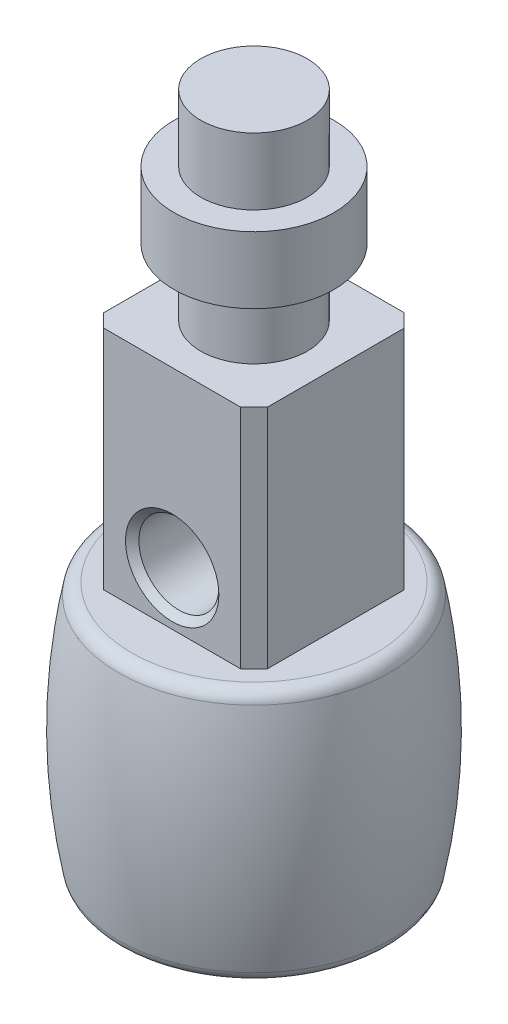
ISO-10303-21;
HEADER;
FILE_DESCRIPTION(('STEP AP214'),'2;1');
FILE_NAME('part.step','',(''),(''),'','','');
FILE_SCHEMA(('AUTOMOTIVE_DESIGN { 1 0 10303 214 1 1 1 1 }'));
ENDSEC;
DATA;
#1=APPLICATION_CONTEXT('core data for automotive mechanical design processes');
#2=APPLICATION_PROTOCOL_DEFINITION('international standard','automotive_design',2000,#1);
#3=PRODUCT_CONTEXT('',#1,'mechanical');
#4=PRODUCT('Part','Part','',(#3));
#5=PRODUCT_RELATED_PRODUCT_CATEGORY('part','',(#4));
#6=PRODUCT_DEFINITION_FORMATION('','',#4);
#7=PRODUCT_DEFINITION_CONTEXT('part definition',#1,'design');
#8=PRODUCT_DEFINITION('design','',#6,#7);
#9=PRODUCT_DEFINITION_SHAPE('','',#8);
#10=(LENGTH_UNIT() NAMED_UNIT(*) SI_UNIT(.MILLI.,.METRE.));
#11=(NAMED_UNIT(*) PLANE_ANGLE_UNIT() SI_UNIT($,.RADIAN.));
#12=(NAMED_UNIT(*) SI_UNIT($,.STERADIAN.) SOLID_ANGLE_UNIT());
#13=UNCERTAINTY_MEASURE_WITH_UNIT(LENGTH_MEASURE(1.E-05),#10,'distance_accuracy_value','');
#14=(GEOMETRIC_REPRESENTATION_CONTEXT(3) GLOBAL_UNCERTAINTY_ASSIGNED_CONTEXT((#13)) GLOBAL_UNIT_ASSIGNED_CONTEXT((#10,
#11,#12)) REPRESENTATION_CONTEXT('',''));
#15=CARTESIAN_POINT('',(0.,0.,0.));
#16=DIRECTION('',(0.,0.,1.));
#17=DIRECTION('',(1.,0.,0.));
#18=AXIS2_PLACEMENT_3D('',#15,#16,#17);
#19=CARTESIAN_POINT('',(4.,36.,0.));
#20=DIRECTION('',(0.,1.,0.));
#21=DIRECTION('',(0.,0.,1.));
#22=AXIS2_PLACEMENT_3D('',#19,#20,#21);
#23=PLANE('',#22);
#24=CARTESIAN_POINT('',(0.,36.,0.));
#25=DIRECTION('',(0.,-1.,0.));
#26=DIRECTION('',(0.,0.,-1.));
#27=AXIS2_PLACEMENT_3D('',#24,#25,#26);
#28=CIRCLE('',#27,4.);
#29=CARTESIAN_POINT('',(0.,36.,-4.));
#30=VERTEX_POINT('',#29);
#31=EDGE_CURVE('E157',#30,#30,#28,.T.);
#32=ORIENTED_EDGE('',*,*,#31,.T.);
#33=EDGE_LOOP('',(#32));
#34=FACE_BOUND('',#33,.T.);
#35=DIRECTION('',(-1.,0.,0.));
#36=VECTOR('',#35,1.);
#37=CARTESIAN_POINT('',(-5.13471383479231,36.,-6.13471383479234));
#38=LINE('',#37,#36);
#39=CARTESIAN_POINT('',(5.13471383479231,36.,-6.13471383479234));
#40=VERTEX_POINT('',#39);
#41=CARTESIAN_POINT('',(-5.13471383479231,36.,-6.13471383479234));
#42=VERTEX_POINT('',#41);
#43=EDGE_CURVE('E125',#40,#42,#38,.T.);
#44=ORIENTED_EDGE('',*,*,#43,.T.);
#45=DIRECTION('',(-0.707106781186548,0.,0.707106781186548));
#46=VECTOR('',#45,1.);
#47=CARTESIAN_POINT('',(-6.13471383479231,36.,-5.13471383479234));
#48=LINE('',#47,#46);
#49=CARTESIAN_POINT('',(-6.13471383479231,36.,-5.13471383479234));
#50=VERTEX_POINT('',#49);
#51=EDGE_CURVE('E53',#42,#50,#48,.T.);
#52=ORIENTED_EDGE('',*,*,#51,.T.);
#53=DIRECTION('',(0.,0.,1.));
#54=VECTOR('',#53,1.);
#55=CARTESIAN_POINT('',(-6.13471383479231,36.,-5.13471383479234));
#56=LINE('',#55,#54);
#57=CARTESIAN_POINT('',(-6.13471383479231,36.,5.13471383479234));
#58=VERTEX_POINT('',#57);
#59=EDGE_CURVE('E114',#50,#58,#56,.T.);
#60=ORIENTED_EDGE('',*,*,#59,.T.);
#61=DIRECTION('',(0.707106781186548,0.,0.707106781186548));
#62=VECTOR('',#61,1.);
#63=CARTESIAN_POINT('',(-6.13471383479231,36.,5.13471383479234));
#64=LINE('',#63,#62);
#65=CARTESIAN_POINT('',(-5.13471383479231,36.,6.13471383479234));
#66=VERTEX_POINT('',#65);
#67=EDGE_CURVE('E120',#58,#66,#64,.T.);
#68=ORIENTED_EDGE('',*,*,#67,.T.);
#69=DIRECTION('',(1.,0.,0.));
#70=VECTOR('',#69,1.);
#71=CARTESIAN_POINT('',(-5.13471383479231,36.,6.13471383479234));
#72=LINE('',#71,#70);
#73=CARTESIAN_POINT('',(5.13471383479231,36.,6.13471383479234));
#74=VERTEX_POINT('',#73);
#75=EDGE_CURVE('E132',#66,#74,#72,.T.);
#76=ORIENTED_EDGE('',*,*,#75,.T.);
#77=DIRECTION('',(0.707106781186548,0.,-0.707106781186548));
#78=VECTOR('',#77,1.);
#79=CARTESIAN_POINT('',(5.13471383479231,36.,6.13471383479234));
#80=LINE('',#79,#78);
#81=CARTESIAN_POINT('',(6.13471383479231,36.,5.13471383479234));
#82=VERTEX_POINT('',#81);
#83=EDGE_CURVE('E135',#74,#82,#80,.T.);
#84=ORIENTED_EDGE('',*,*,#83,.T.);
#85=DIRECTION('',(0.,0.,-1.));
#86=VECTOR('',#85,1.);
#87=CARTESIAN_POINT('',(6.13471383479231,36.,-5.13471383479234));
#88=LINE('',#87,#86);
#89=CARTESIAN_POINT('',(6.13471383479231,36.,-5.13471383479234));
#90=VERTEX_POINT('',#89);
#91=EDGE_CURVE('E138',#82,#90,#88,.T.);
#92=ORIENTED_EDGE('',*,*,#91,.T.);
#93=DIRECTION('',(-0.707106781186548,0.,-0.707106781186548));
#94=VECTOR('',#93,1.);
#95=CARTESIAN_POINT('',(5.13471383479231,36.,-6.13471383479234));
#96=LINE('',#95,#94);
#97=EDGE_CURVE('E141',#90,#40,#96,.T.);
#98=ORIENTED_EDGE('',*,*,#97,.T.);
#99=EDGE_LOOP('',(#44,#52,#60,#68,#76,#84,#92,#98));
#100=FACE_BOUND('',#99,.T.);
#101=ADVANCED_FACE('F38',(#34,#100),#23,.T.);
#102=CARTESIAN_POINT('',(0.,51.,0.));
#103=DIRECTION('',(0.,1.,0.));
#104=DIRECTION('',(0.,0.,1.));
#105=AXIS2_PLACEMENT_3D('',#102,#103,#104);
#106=PLANE('',#105);
#107=CARTESIAN_POINT('',(0.,51.,0.));
#108=DIRECTION('',(0.,-1.,0.));
#109=DIRECTION('',(0.,0.,-1.));
#110=AXIS2_PLACEMENT_3D('',#107,#108,#109);
#111=CIRCLE('',#110,4.);
#112=CARTESIAN_POINT('',(0.,51.,-4.));
#113=VERTEX_POINT('',#112);
#114=EDGE_CURVE('E173',#113,#113,#111,.T.);
#115=ORIENTED_EDGE('',*,*,#114,.F.);
#116=EDGE_LOOP('',(#115));
#117=FACE_BOUND('',#116,.T.);
#118=ADVANCED_FACE('F257',(#117),#106,.T.);
#119=CARTESIAN_POINT('',(0.,0.,0.));
#120=DIRECTION('',(0.,-1.,0.));
#121=DIRECTION('',(0.,0.,-1.));
#122=AXIS2_PLACEMENT_3D('',#119,#120,#121);
#123=CYLINDRICAL_SURFACE('',#122,4.);
#124=ORIENTED_EDGE('',*,*,#114,.T.);
#125=EDGE_LOOP('',(#124));
#126=FACE_BOUND('',#125,.T.);
#127=CARTESIAN_POINT('',(0.,46.0007064793125,0.));
#128=DIRECTION('',(0.,-1.,0.));
#129=DIRECTION('',(0.,0.,-1.));
#130=AXIS2_PLACEMENT_3D('',#127,#128,#129);
#131=CIRCLE('',#130,4.);
#132=CARTESIAN_POINT('',(0.,46.0007064793125,-4.));
#133=VERTEX_POINT('',#132);
#134=EDGE_CURVE('E170',#133,#133,#131,.T.);
#135=ORIENTED_EDGE('',*,*,#134,.F.);
#136=EDGE_LOOP('',(#135));
#137=FACE_BOUND('',#136,.T.);
#138=ADVANCED_FACE('F263',(#126,#137),#123,.T.);
#139=CARTESIAN_POINT('',(4.,46.0007064793125,0.));
#140=DIRECTION('',(0.,1.,0.));
#141=DIRECTION('',(0.,0.,1.));
#142=AXIS2_PLACEMENT_3D('',#139,#140,#141);
#143=PLANE('',#142);
#144=ORIENTED_EDGE('',*,*,#134,.T.);
#145=EDGE_LOOP('',(#144));
#146=FACE_BOUND('',#145,.T.);
#147=CARTESIAN_POINT('',(0.,46.0007064793125,0.));
#148=DIRECTION('',(0.,-1.,0.));
#149=DIRECTION('',(0.,0.,-1.));
#150=AXIS2_PLACEMENT_3D('',#147,#148,#149);
#151=CIRCLE('',#150,6.);
#152=CARTESIAN_POINT('',(0.,46.0007064793125,-6.));
#153=VERTEX_POINT('',#152);
#154=EDGE_CURVE('E167',#153,#153,#151,.T.);
#155=ORIENTED_EDGE('',*,*,#154,.F.);
#156=EDGE_LOOP('',(#155));
#157=FACE_BOUND('',#156,.T.);
#158=ADVANCED_FACE('F280',(#146,#157),#143,.T.);
#159=CARTESIAN_POINT('',(0.,0.,0.));
#160=DIRECTION('',(0.,-1.,0.));
#161=DIRECTION('',(0.,0.,-1.));
#162=AXIS2_PLACEMENT_3D('',#159,#160,#161);
#163=CYLINDRICAL_SURFACE('',#162,6.);
#164=ORIENTED_EDGE('',*,*,#154,.T.);
#165=EDGE_LOOP('',(#164));
#166=FACE_BOUND('',#165,.T.);
#167=CARTESIAN_POINT('',(0.,40.9992935206874,0.));
#168=DIRECTION('',(0.,-1.,0.));
#169=DIRECTION('',(0.,0.,-1.));
#170=AXIS2_PLACEMENT_3D('',#167,#168,#169);
#171=CIRCLE('',#170,6.);
#172=CARTESIAN_POINT('',(0.,40.9992935206874,-6.));
#173=VERTEX_POINT('',#172);
#174=EDGE_CURVE('E164',#173,#173,#171,.T.);
#175=ORIENTED_EDGE('',*,*,#174,.F.);
#176=EDGE_LOOP('',(#175));
#177=FACE_BOUND('',#176,.T.);
#178=ADVANCED_FACE('F276',(#166,#177),#163,.T.);
#179=CARTESIAN_POINT('',(6.,40.9992935206874,0.));
#180=DIRECTION('',(0.,-1.,0.));
#181=DIRECTION('',(0.,0.,-1.));
#182=AXIS2_PLACEMENT_3D('',#179,#180,#181);
#183=PLANE('',#182);
#184=ORIENTED_EDGE('',*,*,#174,.T.);
#185=EDGE_LOOP('',(#184));
#186=FACE_BOUND('',#185,.T.);
#187=CARTESIAN_POINT('',(0.,40.9992935206874,0.));
#188=DIRECTION('',(0.,-1.,0.));
#189=DIRECTION('',(0.,0.,-1.));
#190=AXIS2_PLACEMENT_3D('',#187,#188,#189);
#191=CIRCLE('',#190,4.);
#192=CARTESIAN_POINT('',(0.,40.9992935206874,-4.));
#193=VERTEX_POINT('',#192);
#194=EDGE_CURVE('E160',#193,#193,#191,.T.);
#195=ORIENTED_EDGE('',*,*,#194,.F.);
#196=EDGE_LOOP('',(#195));
#197=FACE_BOUND('',#196,.T.);
#198=ADVANCED_FACE('F272',(#186,#197),#183,.T.);
#199=CARTESIAN_POINT('',(0.,0.,0.));
#200=DIRECTION('',(0.,-1.,0.));
#201=DIRECTION('',(0.,0.,-1.));
#202=AXIS2_PLACEMENT_3D('',#199,#200,#201);
#203=CYLINDRICAL_SURFACE('',#202,4.);
#204=ORIENTED_EDGE('',*,*,#194,.T.);
#205=EDGE_LOOP('',(#204));
#206=FACE_BOUND('',#205,.T.);
#207=ORIENTED_EDGE('',*,*,#31,.F.);
#208=EDGE_LOOP('',(#207));
#209=FACE_BOUND('',#208,.T.);
#210=ADVANCED_FACE('F269',(#206,#209),#203,.T.);
#211=CARTESIAN_POINT('',(-6.13471383479231,-12.4238253559302,-5.13471383479234));
#212=DIRECTION('',(-0.707106781186547,0.,-0.707106781186547));
#213=DIRECTION('',(-0.707106781186548,0.,0.707106781186548));
#214=AXIS2_PLACEMENT_3D('',#211,#212,#213);
#215=PLANE('',#214);
#216=DIRECTION('',(0.,1.,0.));
#217=VECTOR('',#216,1.);
#218=CARTESIAN_POINT('',(-6.13471383479231,-12.4238253559302,-5.13471383479234));
#219=LINE('',#218,#217);
#220=CARTESIAN_POINT('',(-6.13471383479231,19.,-5.13471383479234));
#221=VERTEX_POINT('',#220);
#222=EDGE_CURVE('E103',#221,#50,#219,.T.);
#223=ORIENTED_EDGE('',*,*,#222,.T.);
#224=ORIENTED_EDGE('',*,*,#51,.F.);
#225=DIRECTION('',(0.,1.,0.));
#226=VECTOR('',#225,1.);
#227=CARTESIAN_POINT('',(-5.13471383479231,-12.4238253559302,-6.13471383479234));
#228=LINE('',#227,#226);
#229=CARTESIAN_POINT('',(-5.13471383479231,19.,-6.13471383479234));
#230=VERTEX_POINT('',#229);
#231=EDGE_CURVE('E111',#230,#42,#228,.T.);
#232=ORIENTED_EDGE('',*,*,#231,.F.);
#233=DIRECTION('',(0.707106781186548,0.,-0.707106781186548));
#234=VECTOR('',#233,1.);
#235=CARTESIAN_POINT('',(-6.13471383479231,19.,-5.13471383479234));
#236=LINE('',#235,#234);
#237=EDGE_CURVE('E107',#221,#230,#236,.T.);
#238=ORIENTED_EDGE('',*,*,#237,.F.);
#239=EDGE_LOOP('',(#223,#224,#232,#238));
#240=FACE_BOUND('',#239,.T.);
#241=ADVANCED_FACE('F105',(#240),#215,.T.);
#242=CARTESIAN_POINT('',(-6.13471383479231,-12.4238253559302,-5.13471383479234));
#243=DIRECTION('',(-1.,0.,0.));
#244=DIRECTION('',(0.,0.,1.));
#245=AXIS2_PLACEMENT_3D('',#242,#243,#244);
#246=PLANE('',#245);
#247=DIRECTION('',(0.,1.,0.));
#248=VECTOR('',#247,1.);
#249=CARTESIAN_POINT('',(-6.13471383479231,-12.4238253559302,5.13471383479234));
#250=LINE('',#249,#248);
#251=CARTESIAN_POINT('',(-6.13471383479231,19.,5.13471383479234));
#252=VERTEX_POINT('',#251);
#253=EDGE_CURVE('E110',#252,#58,#250,.T.);
#254=ORIENTED_EDGE('',*,*,#253,.T.);
#255=ORIENTED_EDGE('',*,*,#59,.F.);
#256=ORIENTED_EDGE('',*,*,#222,.F.);
#257=DIRECTION('',(0.,0.,-1.));
#258=VECTOR('',#257,1.);
#259=CARTESIAN_POINT('',(-6.13471383479231,19.,-5.13471383479234));
#260=LINE('',#259,#258);
#261=EDGE_CURVE('E161',#252,#221,#260,.T.);
#262=ORIENTED_EDGE('',*,*,#261,.F.);
#263=EDGE_LOOP('',(#254,#255,#256,#262));
#264=FACE_BOUND('',#263,.T.);
#265=ADVANCED_FACE('F115',(#264),#246,.T.);
#266=CARTESIAN_POINT('',(-6.13471383479231,-12.4238253559302,5.13471383479234));
#267=DIRECTION('',(-0.707106781186547,0.,0.707106781186547));
#268=DIRECTION('',(0.707106781186548,0.,0.707106781186548));
#269=AXIS2_PLACEMENT_3D('',#266,#267,#268);
#270=PLANE('',#269);
#271=DIRECTION('',(0.,1.,0.));
#272=VECTOR('',#271,1.);
#273=CARTESIAN_POINT('',(-5.13471383479231,-12.4238253559302,6.13471383479234));
#274=LINE('',#273,#272);
#275=CARTESIAN_POINT('',(-5.13471383479231,19.,6.13471383479234));
#276=VERTEX_POINT('',#275);
#277=EDGE_CURVE('E151',#276,#66,#274,.T.);
#278=ORIENTED_EDGE('',*,*,#277,.T.);
#279=ORIENTED_EDGE('',*,*,#67,.F.);
#280=ORIENTED_EDGE('',*,*,#253,.F.);
#281=DIRECTION('',(-0.707106781186548,0.,-0.707106781186548));
#282=VECTOR('',#281,1.);
#283=CARTESIAN_POINT('',(-6.13471383479231,19.,5.13471383479234));
#284=LINE('',#283,#282);
#285=EDGE_CURVE('E215',#276,#252,#284,.T.);
#286=ORIENTED_EDGE('',*,*,#285,.F.);
#287=EDGE_LOOP('',(#278,#279,#280,#286));
#288=FACE_BOUND('',#287,.T.);
#289=ADVANCED_FACE('F246',(#288),#270,.T.);
#290=CARTESIAN_POINT('',(-5.13471383479231,-12.4238253559302,6.13471383479234));
#291=DIRECTION('',(0.,0.,1.));
#292=DIRECTION('',(1.,0.,0.));
#293=AXIS2_PLACEMENT_3D('',#290,#291,#292);
#294=PLANE('',#293);
#295=CARTESIAN_POINT('',(0.000286165207687324,23.,6.13471383479234));
#296=DIRECTION('',(0.,0.,1.));
#297=DIRECTION('',(1.,0.,0.));
#298=AXIS2_PLACEMENT_3D('',#295,#296,#297);
#299=CIRCLE('',#298,3.50000000000001);
#300=CARTESIAN_POINT('',(3.5002861652077,23.,6.13471383479234));
#301=VERTEX_POINT('',#300);
#302=EDGE_CURVE('E179',#301,#301,#299,.F.);
#303=ORIENTED_EDGE('',*,*,#302,.T.);
#304=EDGE_LOOP('',(#303));
#305=FACE_BOUND('',#304,.T.);
#306=DIRECTION('',(0.,1.,0.));
#307=VECTOR('',#306,1.);
#308=CARTESIAN_POINT('',(5.13471383479231,-12.4238253559302,6.13471383479234));
#309=LINE('',#308,#307);
#310=CARTESIAN_POINT('',(5.13471383479231,19.,6.13471383479234));
#311=VERTEX_POINT('',#310);
#312=EDGE_CURVE('E149',#311,#74,#309,.T.);
#313=ORIENTED_EDGE('',*,*,#312,.T.);
#314=ORIENTED_EDGE('',*,*,#75,.F.);
#315=ORIENTED_EDGE('',*,*,#277,.F.);
#316=DIRECTION('',(-1.,0.,0.));
#317=VECTOR('',#316,1.);
#318=CARTESIAN_POINT('',(-5.13471383479231,19.,6.13471383479234));
#319=LINE('',#318,#317);
#320=EDGE_CURVE('E61',#311,#276,#319,.T.);
#321=ORIENTED_EDGE('',*,*,#320,.F.);
#322=EDGE_LOOP('',(#313,#314,#315,#321));
#323=FACE_BOUND('',#322,.T.);
#324=ADVANCED_FACE('F243',(#305,#323),#294,.T.);
#325=CARTESIAN_POINT('',(5.13471383479231,-12.4238253559302,6.13471383479234));
#326=DIRECTION('',(0.707106781186547,0.,0.707106781186547));
#327=DIRECTION('',(0.707106781186548,0.,-0.707106781186548));
#328=AXIS2_PLACEMENT_3D('',#325,#326,#327);
#329=PLANE('',#328);
#330=DIRECTION('',(0.,1.,0.));
#331=VECTOR('',#330,1.);
#332=CARTESIAN_POINT('',(6.13471383479231,-12.4238253559302,5.13471383479234));
#333=LINE('',#332,#331);
#334=CARTESIAN_POINT('',(6.13471383479231,19.,5.13471383479234));
#335=VERTEX_POINT('',#334);
#336=EDGE_CURVE('E147',#335,#82,#333,.T.);
#337=ORIENTED_EDGE('',*,*,#336,.T.);
#338=ORIENTED_EDGE('',*,*,#83,.F.);
#339=ORIENTED_EDGE('',*,*,#312,.F.);
#340=DIRECTION('',(-0.707106781186548,0.,0.707106781186548));
#341=VECTOR('',#340,1.);
#342=CARTESIAN_POINT('',(5.13471383479231,19.,6.13471383479234));
#343=LINE('',#342,#341);
#344=EDGE_CURVE('E218',#335,#311,#343,.T.);
#345=ORIENTED_EDGE('',*,*,#344,.F.);
#346=EDGE_LOOP('',(#337,#338,#339,#345));
#347=FACE_BOUND('',#346,.T.);
#348=ADVANCED_FACE('F239',(#347),#329,.T.);
#349=CARTESIAN_POINT('',(6.13471383479231,-12.4238253559302,-5.13471383479234));
#350=DIRECTION('',(1.,0.,0.));
#351=DIRECTION('',(0.,0.,-1.));
#352=AXIS2_PLACEMENT_3D('',#349,#350,#351);
#353=PLANE('',#352);
#354=DIRECTION('',(0.,1.,0.));
#355=VECTOR('',#354,1.);
#356=CARTESIAN_POINT('',(6.13471383479231,-12.4238253559302,-5.13471383479234));
#357=LINE('',#356,#355);
#358=CARTESIAN_POINT('',(6.13471383479231,19.,-5.13471383479234));
#359=VERTEX_POINT('',#358);
#360=EDGE_CURVE('E145',#359,#90,#357,.T.);
#361=ORIENTED_EDGE('',*,*,#360,.T.);
#362=ORIENTED_EDGE('',*,*,#91,.F.);
#363=ORIENTED_EDGE('',*,*,#336,.F.);
#364=DIRECTION('',(0.,0.,1.));
#365=VECTOR('',#364,1.);
#366=CARTESIAN_POINT('',(6.13471383479231,19.,-5.13471383479234));
#367=LINE('',#366,#365);
#368=EDGE_CURVE('E220',#359,#335,#367,.T.);
#369=ORIENTED_EDGE('',*,*,#368,.F.);
#370=EDGE_LOOP('',(#361,#362,#363,#369));
#371=FACE_BOUND('',#370,.T.);
#372=ADVANCED_FACE('F235',(#371),#353,.T.);
#373=CARTESIAN_POINT('',(5.13471383479231,-12.4238253559302,-6.13471383479234));
#374=DIRECTION('',(0.707106781186547,0.,-0.707106781186547));
#375=DIRECTION('',(-0.707106781186548,0.,-0.707106781186548));
#376=AXIS2_PLACEMENT_3D('',#373,#374,#375);
#377=PLANE('',#376);
#378=DIRECTION('',(0.,1.,0.));
#379=VECTOR('',#378,1.);
#380=CARTESIAN_POINT('',(5.13471383479231,-12.4238253559302,-6.13471383479234));
#381=LINE('',#380,#379);
#382=CARTESIAN_POINT('',(5.13471383479231,19.,-6.13471383479234));
#383=VERTEX_POINT('',#382);
#384=EDGE_CURVE('E143',#383,#40,#381,.T.);
#385=ORIENTED_EDGE('',*,*,#384,.T.);
#386=ORIENTED_EDGE('',*,*,#97,.F.);
#387=ORIENTED_EDGE('',*,*,#360,.F.);
#388=DIRECTION('',(0.707106781186548,0.,0.707106781186548));
#389=VECTOR('',#388,1.);
#390=CARTESIAN_POINT('',(5.13471383479231,19.,-6.13471383479234));
#391=LINE('',#390,#389);
#392=EDGE_CURVE('E223',#383,#359,#391,.T.);
#393=ORIENTED_EDGE('',*,*,#392,.F.);
#394=EDGE_LOOP('',(#385,#386,#387,#393));
#395=FACE_BOUND('',#394,.T.);
#396=ADVANCED_FACE('F231',(#395),#377,.T.);
#397=CARTESIAN_POINT('',(-5.13471383479231,-12.4238253559302,-6.13471383479234));
#398=DIRECTION('',(0.,0.,-1.));
#399=DIRECTION('',(-1.,0.,0.));
#400=AXIS2_PLACEMENT_3D('',#397,#398,#399);
#401=PLANE('',#400);
#402=ORIENTED_EDGE('',*,*,#231,.T.);
#403=ORIENTED_EDGE('',*,*,#43,.F.);
#404=ORIENTED_EDGE('',*,*,#384,.F.);
#405=DIRECTION('',(1.,0.,0.));
#406=VECTOR('',#405,1.);
#407=CARTESIAN_POINT('',(-5.13471383479231,19.,-6.13471383479234));
#408=LINE('',#407,#406);
#409=EDGE_CURVE('E156',#230,#383,#408,.T.);
#410=ORIENTED_EDGE('',*,*,#409,.F.);
#411=EDGE_LOOP('',(#402,#403,#404,#410));
#412=FACE_BOUND('',#411,.T.);
#413=ADVANCED_FACE('F203',(#412),#401,.T.);
#414=CARTESIAN_POINT('',(0.,0.,0.));
#415=DIRECTION('',(0.,-1.,0.));
#416=DIRECTION('',(0.,0.,-1.));
#417=AXIS2_PLACEMENT_3D('',#414,#415,#416);
#418=PLANE('',#417);
#419=CARTESIAN_POINT('',(0.,0.,0.));
#420=DIRECTION('',(0.,-1.,0.));
#421=DIRECTION('',(0.,0.,-1.));
#422=AXIS2_PLACEMENT_3D('',#419,#420,#421);
#423=CIRCLE('',#422,9.18299727218765);
#424=CARTESIAN_POINT('',(0.,0.,-9.18299727218765));
#425=VERTEX_POINT('',#424);
#426=EDGE_CURVE('E183',#425,#425,#423,.T.);
#427=ORIENTED_EDGE('',*,*,#426,.T.);
#428=EDGE_LOOP('',(#427));
#429=FACE_BOUND('',#428,.T.);
#430=CARTESIAN_POINT('',(0.,0.,0.));
#431=DIRECTION('',(0.,-1.,0.));
#432=DIRECTION('',(0.,0.,-1.));
#433=AXIS2_PLACEMENT_3D('',#430,#431,#432);
#434=CIRCLE('',#433,5.);
#435=CARTESIAN_POINT('',(0.,0.,-5.));
#436=VERTEX_POINT('',#435);
#437=EDGE_CURVE('E182',#436,#436,#434,.T.);
#438=ORIENTED_EDGE('',*,*,#437,.F.);
#439=EDGE_LOOP('',(#438));
#440=FACE_BOUND('',#439,.T.);
#441=ADVANCED_FACE('F200',(#429,#440),#418,.T.);
#442=CARTESIAN_POINT('',(0.,9.5,0.));
#443=DIRECTION('',(0.,-1.,0.));
#444=DIRECTION('',(0.,0.,-1.));
#445=AXIS2_PLACEMENT_3D('',#442,#443,#444);
#446=DEGENERATE_TOROIDAL_SURFACE('',#445,34.6250000000001,45.6250000000001,.F.);
#447=CARTESIAN_POINT('',(0.,0.809523809523816,0.));
#448=DIRECTION('',(0.,1.,0.));
#449=DIRECTION('',(0.,0.,1.));
#450=AXIS2_PLACEMENT_3D('',#447,#448,#449);
#451=CIRCLE('',#450,10.1646890878109);
#452=CARTESIAN_POINT('',(0.,0.809523809523816,10.1646890878109));
#453=VERTEX_POINT('',#452);
#454=EDGE_CURVE('E46',#453,#453,#451,.T.);
#455=ORIENTED_EDGE('',*,*,#454,.T.);
#456=EDGE_LOOP('',(#455));
#457=FACE_BOUND('',#456,.T.);
#458=CARTESIAN_POINT('',(0.,18.1904761904762,0.));
#459=DIRECTION('',(0.,-1.,0.));
#460=DIRECTION('',(0.,0.,-1.));
#461=AXIS2_PLACEMENT_3D('',#458,#459,#460);
#462=CIRCLE('',#461,10.1646890878109);
#463=CARTESIAN_POINT('',(0.,18.1904761904762,-10.1646890878109));
#464=VERTEX_POINT('',#463);
#465=EDGE_CURVE('E186',#464,#464,#462,.T.);
#466=ORIENTED_EDGE('',*,*,#465,.T.);
#467=EDGE_LOOP('',(#466));
#468=FACE_BOUND('',#467,.T.);
#469=ADVANCED_FACE('F191',(#457,#468),#446,.F.);
#470=CARTESIAN_POINT('',(8.,19.,0.));
#471=DIRECTION('',(0.,1.,0.));
#472=DIRECTION('',(0.,0.,1.));
#473=AXIS2_PLACEMENT_3D('',#470,#471,#472);
#474=PLANE('',#473);
#475=CARTESIAN_POINT('',(0.,19.,0.));
#476=DIRECTION('',(0.,1.,0.));
#477=DIRECTION('',(0.,0.,1.));
#478=AXIS2_PLACEMENT_3D('',#475,#476,#477);
#479=CIRCLE('',#478,9.18299727218764);
#480=CARTESIAN_POINT('',(0.,19.,9.18299727218764));
#481=VERTEX_POINT('',#480);
#482=EDGE_CURVE('E13',#481,#481,#479,.T.);
#483=ORIENTED_EDGE('',*,*,#482,.T.);
#484=EDGE_LOOP('',(#483));
#485=FACE_BOUND('',#484,.T.);
#486=ORIENTED_EDGE('',*,*,#320,.T.);
#487=ORIENTED_EDGE('',*,*,#285,.T.);
#488=ORIENTED_EDGE('',*,*,#261,.T.);
#489=ORIENTED_EDGE('',*,*,#237,.T.);
#490=ORIENTED_EDGE('',*,*,#409,.T.);
#491=ORIENTED_EDGE('',*,*,#392,.T.);
#492=ORIENTED_EDGE('',*,*,#368,.T.);
#493=ORIENTED_EDGE('',*,*,#344,.T.);
#494=EDGE_LOOP('',(#486,#487,#488,#489,#490,#491,#492,#493));
#495=FACE_BOUND('',#494,.T.);
#496=ADVANCED_FACE('F226',(#485,#495),#474,.T.);
#497=CARTESIAN_POINT('',(-5.13471383479231,-12.4238253559302,-2.13471383479233));
#498=DIRECTION('',(0.,0.,-1.));
#499=DIRECTION('',(-1.,0.,0.));
#500=AXIS2_PLACEMENT_3D('',#497,#498,#499);
#501=PLANE('',#500);
#502=CARTESIAN_POINT('',(0.000286165207687324,23.,-2.13471383479234));
#503=DIRECTION('',(0.,0.,-1.));
#504=DIRECTION('',(-1.,0.,0.));
#505=AXIS2_PLACEMENT_3D('',#502,#503,#504);
#506=CIRCLE('',#505,3.);
#507=CARTESIAN_POINT('',(-2.99971383479231,23.,-2.13471383479234));
#508=VERTEX_POINT('',#507);
#509=EDGE_CURVE('E127',#508,#508,#506,.F.);
#510=ORIENTED_EDGE('',*,*,#509,.T.);
#511=EDGE_LOOP('',(#510));
#512=FACE_BOUND('',#511,.T.);
#513=ADVANCED_FACE('F299',(#512),#501,.F.);
#514=CARTESIAN_POINT('',(0.000286165207687324,23.,-14.6199952090309));
#515=DIRECTION('',(0.,0.,1.));
#516=DIRECTION('',(1.,0.,0.));
#517=AXIS2_PLACEMENT_3D('',#514,#515,#516);
#518=CYLINDRICAL_SURFACE('',#517,3.);
#519=CARTESIAN_POINT('',(0.000286165207687324,23.,5.63471383479232));
#520=DIRECTION('',(0.,0.,1.));
#521=DIRECTION('',(1.,0.,0.));
#522=AXIS2_PLACEMENT_3D('',#519,#520,#521);
#523=CIRCLE('',#522,3.);
#524=CARTESIAN_POINT('',(3.00028616520769,23.,5.63471383479232));
#525=VERTEX_POINT('',#524);
#526=EDGE_CURVE('E176',#525,#525,#523,.T.);
#527=ORIENTED_EDGE('',*,*,#526,.T.);
#528=EDGE_LOOP('',(#527));
#529=FACE_BOUND('',#528,.T.);
#530=ORIENTED_EDGE('',*,*,#509,.F.);
#531=EDGE_LOOP('',(#530));
#532=FACE_BOUND('',#531,.T.);
#533=ADVANCED_FACE('F291',(#529,#532),#518,.F.);
#534=CARTESIAN_POINT('',(0.000286165207687324,23.,5.63471383479232));
#535=DIRECTION('',(0.,0.,1.));
#536=DIRECTION('',(1.,0.,0.));
#537=AXIS2_PLACEMENT_3D('',#534,#535,#536);
#538=CONICAL_SURFACE('',#537,3.,0.785398163397444);
#539=ORIENTED_EDGE('',*,*,#302,.F.);
#540=EDGE_LOOP('',(#539));
#541=FACE_BOUND('',#540,.T.);
#542=ORIENTED_EDGE('',*,*,#526,.F.);
#543=EDGE_LOOP('',(#542));
#544=FACE_BOUND('',#543,.T.);
#545=ADVANCED_FACE('F288',(#541,#544),#538,.F.);
#546=CARTESIAN_POINT('',(0.,-1.,0.));
#547=DIRECTION('',(0.,1.,0.));
#548=DIRECTION('',(0.,0.,1.));
#549=AXIS2_PLACEMENT_3D('',#546,#547,#548);
#550=CYLINDRICAL_SURFACE('',#549,5.);
#551=CARTESIAN_POINT('',(0.,-1.,0.));
#552=DIRECTION('',(0.,-1.,0.));
#553=DIRECTION('',(0.,0.,-1.));
#554=AXIS2_PLACEMENT_3D('',#551,#552,#553);
#555=CIRCLE('',#554,5.);
#556=CARTESIAN_POINT('',(0.,-1.,-5.));
#557=VERTEX_POINT('',#556);
#558=EDGE_CURVE('E211',#557,#557,#555,.T.);
#559=ORIENTED_EDGE('',*,*,#558,.F.);
#560=EDGE_LOOP('',(#559));
#561=FACE_BOUND('',#560,.T.);
#562=ORIENTED_EDGE('',*,*,#437,.T.);
#563=EDGE_LOOP('',(#562));
#564=FACE_BOUND('',#563,.T.);
#565=ADVANCED_FACE('F290',(#561,#564),#550,.T.);
#566=CARTESIAN_POINT('',(0.,-1.,0.));
#567=DIRECTION('',(0.,-1.,0.));
#568=DIRECTION('',(0.,0.,-1.));
#569=AXIS2_PLACEMENT_3D('',#566,#567,#568);
#570=PLANE('',#569);
#571=ORIENTED_EDGE('',*,*,#558,.T.);
#572=EDGE_LOOP('',(#571));
#573=FACE_BOUND('',#572,.T.);
#574=ADVANCED_FACE('F197',(#573),#570,.T.);
#575=CARTESIAN_POINT('',(0.,1.00000000000001,0.));
#576=DIRECTION('',(0.,-1.,0.));
#577=DIRECTION('',(0.,0.,-1.));
#578=AXIS2_PLACEMENT_3D('',#575,#576,#577);
#579=TOROIDAL_SURFACE('',#578,9.18299727218765,1.);
#580=ORIENTED_EDGE('',*,*,#454,.F.);
#581=EDGE_LOOP('',(#580));
#582=FACE_BOUND('',#581,.T.);
#583=ORIENTED_EDGE('',*,*,#426,.F.);
#584=EDGE_LOOP('',(#583));
#585=FACE_BOUND('',#584,.T.);
#586=ADVANCED_FACE('F194',(#582,#585),#579,.T.);
#587=CARTESIAN_POINT('',(0.,18.,0.));
#588=DIRECTION('',(0.,1.,0.));
#589=DIRECTION('',(0.,0.,1.));
#590=AXIS2_PLACEMENT_3D('',#587,#588,#589);
#591=TOROIDAL_SURFACE('',#590,9.18299727218764,1.);
#592=ORIENTED_EDGE('',*,*,#482,.F.);
#593=EDGE_LOOP('',(#592));
#594=FACE_BOUND('',#593,.T.);
#595=ORIENTED_EDGE('',*,*,#465,.F.);
#596=EDGE_LOOP('',(#595));
#597=FACE_BOUND('',#596,.T.);
#598=ADVANCED_FACE('F40',(#594,#597),#591,.T.);
#599=CLOSED_SHELL('',(#101,#118,#138,#158,#178,#198,#210,#241,#265,#289,#324,#348,#372,#396,
#413,#441,#469,#496,#513,#533,#545,#565,#574,#586,#598));
#600=MANIFOLD_SOLID_BREP('B2',#599);
#601=ADVANCED_BREP_SHAPE_REPRESENTATION('',(#18,#600),#14);
#602=SHAPE_DEFINITION_REPRESENTATION(#9,#601);
ENDSEC;
END-ISO-10303-21;
